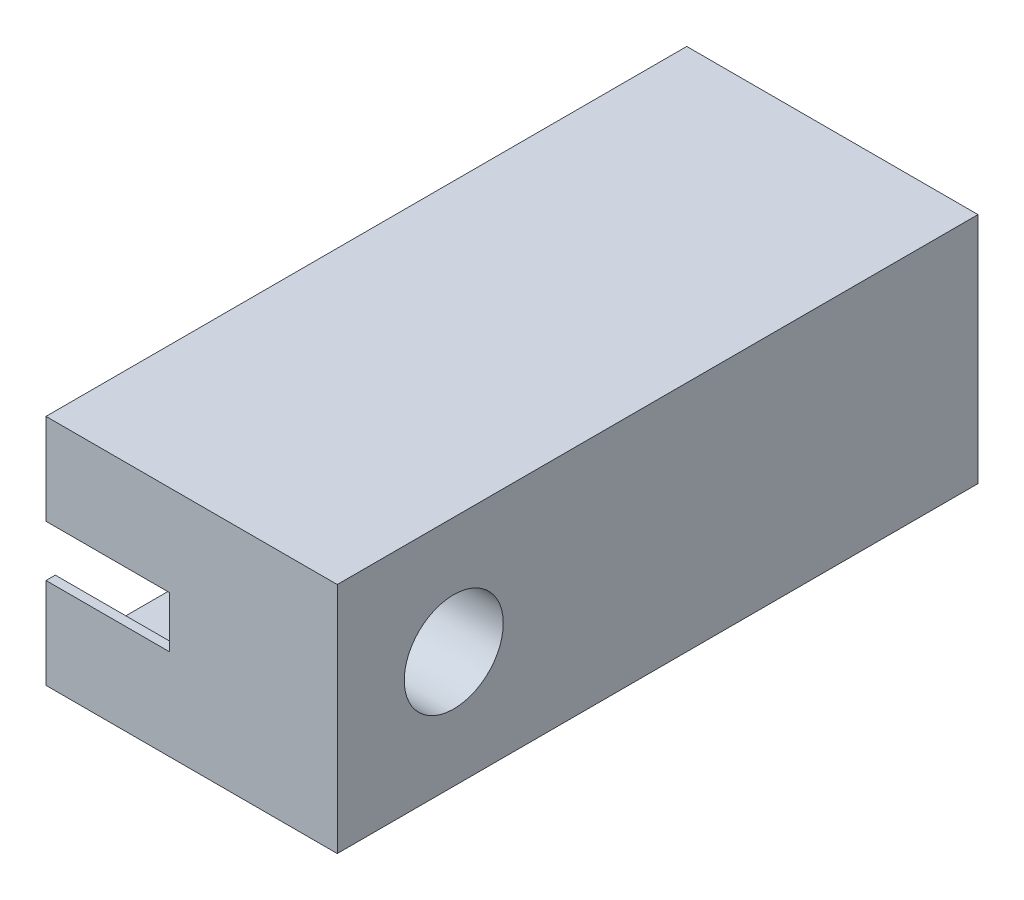
ISO-10303-21;
HEADER;
FILE_DESCRIPTION(('STEP AP214'),'2;1');
FILE_NAME('part.step','',(''),(''),'','','');
FILE_SCHEMA(('AUTOMOTIVE_DESIGN { 1 0 10303 214 1 1 1 1 }'));
ENDSEC;
DATA;
#1=APPLICATION_CONTEXT('core data for automotive mechanical design processes');
#2=APPLICATION_PROTOCOL_DEFINITION('international standard','automotive_design',2000,#1);
#3=PRODUCT_CONTEXT('',#1,'mechanical');
#4=PRODUCT('Part','Part','',(#3));
#5=PRODUCT_RELATED_PRODUCT_CATEGORY('part','',(#4));
#6=PRODUCT_DEFINITION_FORMATION('','',#4);
#7=PRODUCT_DEFINITION_CONTEXT('part definition',#1,'design');
#8=PRODUCT_DEFINITION('design','',#6,#7);
#9=PRODUCT_DEFINITION_SHAPE('','',#8);
#10=(LENGTH_UNIT() NAMED_UNIT(*) SI_UNIT(.MILLI.,.METRE.));
#11=(NAMED_UNIT(*) PLANE_ANGLE_UNIT() SI_UNIT($,.RADIAN.));
#12=(NAMED_UNIT(*) SI_UNIT($,.STERADIAN.) SOLID_ANGLE_UNIT());
#13=UNCERTAINTY_MEASURE_WITH_UNIT(LENGTH_MEASURE(1.E-05),#10,'distance_accuracy_value','');
#14=(GEOMETRIC_REPRESENTATION_CONTEXT(3) GLOBAL_UNCERTAINTY_ASSIGNED_CONTEXT((#13)) GLOBAL_UNIT_ASSIGNED_CONTEXT((#10,
#11,#12)) REPRESENTATION_CONTEXT('',''));
#15=CARTESIAN_POINT('',(0.,0.,0.));
#16=DIRECTION('',(0.,0.,1.));
#17=DIRECTION('',(1.,0.,0.));
#18=AXIS2_PLACEMENT_3D('',#15,#16,#17);
#19=CARTESIAN_POINT('',(31.75,6.35,-53.975));
#20=DIRECTION('',(-1.,0.,0.));
#21=DIRECTION('',(0.,0.,1.));
#22=AXIS2_PLACEMENT_3D('',#19,#20,#21);
#23=CYLINDRICAL_SURFACE('',#22,1.5875);
#24=CARTESIAN_POINT('',(22.86,6.35,-53.975));
#25=DIRECTION('',(-1.,0.,0.));
#26=DIRECTION('',(0.,0.,1.));
#27=AXIS2_PLACEMENT_3D('',#24,#25,#26);
#28=CIRCLE('',#27,1.5875);
#29=CARTESIAN_POINT('',(22.86,6.35,-52.3875));
#30=VERTEX_POINT('',#29);
#31=EDGE_CURVE('E359',#30,#30,#28,.T.);
#32=ORIENTED_EDGE('',*,*,#31,.T.);
#33=EDGE_LOOP('',(#32));
#34=FACE_BOUND('',#33,.T.);
#35=CARTESIAN_POINT('',(29.21,6.35,-53.975));
#36=DIRECTION('',(1.,0.,0.));
#37=DIRECTION('',(0.,0.,-1.));
#38=AXIS2_PLACEMENT_3D('',#35,#36,#37);
#39=CIRCLE('',#38,1.5875);
#40=CARTESIAN_POINT('',(29.21,6.35,-55.5625));
#41=VERTEX_POINT('',#40);
#42=EDGE_CURVE('E11',#41,#41,#39,.F.);
#43=ORIENTED_EDGE('',*,*,#42,.F.);
#44=EDGE_LOOP('',(#43));
#45=FACE_BOUND('',#44,.T.);
#46=ADVANCED_FACE('F45',(#34,#45),#23,.F.);
#47=CARTESIAN_POINT('',(31.75,-6.35,-53.975));
#48=DIRECTION('',(-1.,0.,0.));
#49=DIRECTION('',(0.,0.,1.));
#50=AXIS2_PLACEMENT_3D('',#47,#48,#49);
#51=CYLINDRICAL_SURFACE('',#50,1.5875);
#52=CARTESIAN_POINT('',(22.86,-6.35,-53.975));
#53=DIRECTION('',(-1.,0.,0.));
#54=DIRECTION('',(0.,0.,1.));
#55=AXIS2_PLACEMENT_3D('',#52,#53,#54);
#56=CIRCLE('',#55,1.5875);
#57=CARTESIAN_POINT('',(22.86,-6.35,-52.3875));
#58=VERTEX_POINT('',#57);
#59=EDGE_CURVE('E362',#58,#58,#56,.T.);
#60=ORIENTED_EDGE('',*,*,#59,.T.);
#61=EDGE_LOOP('',(#60));
#62=FACE_BOUND('',#61,.T.);
#63=CARTESIAN_POINT('',(29.21,-6.35,-53.975));
#64=DIRECTION('',(1.,0.,0.));
#65=DIRECTION('',(0.,0.,-1.));
#66=AXIS2_PLACEMENT_3D('',#63,#64,#65);
#67=CIRCLE('',#66,1.5875);
#68=CARTESIAN_POINT('',(29.21,-6.35,-55.5625));
#69=VERTEX_POINT('',#68);
#70=EDGE_CURVE('E54',#69,#69,#67,.F.);
#71=ORIENTED_EDGE('',*,*,#70,.F.);
#72=EDGE_LOOP('',(#71));
#73=FACE_BOUND('',#72,.T.);
#74=ADVANCED_FACE('F266',(#62,#73),#51,.F.);
#75=CARTESIAN_POINT('',(0.,0.,0.));
#76=DIRECTION('',(1.,0.,0.));
#77=DIRECTION('',(0.,0.,-1.));
#78=AXIS2_PLACEMENT_3D('',#75,#76,#77);
#79=PLANE('',#78);
#80=DIRECTION('',(0.,0.,1.));
#81=VECTOR('',#80,1.);
#82=CARTESIAN_POINT('',(0.,2.794,11.684));
#83=LINE('',#82,#81);
#84=CARTESIAN_POINT('',(0.,2.794,11.684));
#85=VERTEX_POINT('',#84);
#86=CARTESIAN_POINT('',(0.,2.794,12.7));
#87=VERTEX_POINT('',#86);
#88=EDGE_CURVE('E355',#85,#87,#83,.T.);
#89=ORIENTED_EDGE('',*,*,#88,.T.);
#90=DIRECTION('',(0.,-1.,0.));
#91=VECTOR('',#90,1.);
#92=CARTESIAN_POINT('',(0.,12.7,12.7));
#93=LINE('',#92,#91);
#94=CARTESIAN_POINT('',(0.,12.7,12.7));
#95=VERTEX_POINT('',#94);
#96=EDGE_CURVE('E223',#95,#87,#93,.T.);
#97=ORIENTED_EDGE('',*,*,#96,.F.);
#98=DIRECTION('',(0.,0.,1.));
#99=VECTOR('',#98,1.);
#100=CARTESIAN_POINT('',(0.,12.7,12.7));
#101=LINE('',#100,#99);
#102=CARTESIAN_POINT('',(0.,12.7,-57.15));
#103=VERTEX_POINT('',#102);
#104=EDGE_CURVE('E213',#103,#95,#101,.T.);
#105=ORIENTED_EDGE('',*,*,#104,.F.);
#106=DIRECTION('',(0.,1.,0.));
#107=VECTOR('',#106,1.);
#108=CARTESIAN_POINT('',(0.,12.7,-57.15));
#109=LINE('',#108,#107);
#110=CARTESIAN_POINT('',(0.,10.4775,-57.15));
#111=VERTEX_POINT('',#110);
#112=EDGE_CURVE('E230',#111,#103,#109,.T.);
#113=ORIENTED_EDGE('',*,*,#112,.F.);
#114=DIRECTION('',(0.,0.,1.));
#115=VECTOR('',#114,1.);
#116=CARTESIAN_POINT('',(0.,10.4775,-59.69));
#117=LINE('',#116,#115);
#118=CARTESIAN_POINT('',(0.,10.4775,11.684));
#119=VERTEX_POINT('',#118);
#120=EDGE_CURVE('E186',#111,#119,#117,.T.);
#121=ORIENTED_EDGE('',*,*,#120,.T.);
#122=DIRECTION('',(0.,-1.,0.));
#123=VECTOR('',#122,1.);
#124=CARTESIAN_POINT('',(0.,10.4775,11.684));
#125=LINE('',#124,#123);
#126=EDGE_CURVE('E176',#119,#85,#125,.T.);
#127=ORIENTED_EDGE('',*,*,#126,.T.);
#128=EDGE_LOOP('',(#89,#97,#105,#113,#121,#127));
#129=FACE_BOUND('',#128,.T.);
#130=ADVANCED_FACE('F268',(#129),#79,.F.);
#131=CARTESIAN_POINT('',(31.75,12.7,12.7));
#132=DIRECTION('',(0.,0.,-1.));
#133=DIRECTION('',(0.,1.,0.));
#134=AXIS2_PLACEMENT_3D('',#131,#132,#133);
#135=PLANE('',#134);
#136=DIRECTION('',(-1.,0.,0.));
#137=VECTOR('',#136,1.);
#138=CARTESIAN_POINT('',(31.75,2.794,12.7));
#139=LINE('',#138,#137);
#140=CARTESIAN_POINT('',(13.462,2.794,12.7));
#141=VERTEX_POINT('',#140);
#142=EDGE_CURVE('E168',#141,#87,#139,.T.);
#143=ORIENTED_EDGE('',*,*,#142,.F.);
#144=DIRECTION('',(0.,-1.,0.));
#145=VECTOR('',#144,1.);
#146=CARTESIAN_POINT('',(13.462,12.7,12.7));
#147=LINE('',#146,#145);
#148=CARTESIAN_POINT('',(13.462,-2.794,12.7));
#149=VERTEX_POINT('',#148);
#150=EDGE_CURVE('E158',#141,#149,#147,.T.);
#151=ORIENTED_EDGE('',*,*,#150,.T.);
#152=DIRECTION('',(-1.,0.,0.));
#153=VECTOR('',#152,1.);
#154=CARTESIAN_POINT('',(31.75,-2.794,12.7));
#155=LINE('',#154,#153);
#156=CARTESIAN_POINT('',(0.,-2.794,12.7));
#157=VERTEX_POINT('',#156);
#158=EDGE_CURVE('E141',#149,#157,#155,.T.);
#159=ORIENTED_EDGE('',*,*,#158,.T.);
#160=CARTESIAN_POINT('',(0.,-12.7,12.7));
#161=VERTEX_POINT('',#160);
#162=EDGE_CURVE('E207',#157,#161,#93,.T.);
#163=ORIENTED_EDGE('',*,*,#162,.T.);
#164=DIRECTION('',(-1.,0.,0.));
#165=VECTOR('',#164,1.);
#166=CARTESIAN_POINT('',(31.75,-12.7,12.7));
#167=LINE('',#166,#165);
#168=CARTESIAN_POINT('',(31.75,-12.7,12.7));
#169=VERTEX_POINT('',#168);
#170=EDGE_CURVE('E248',#169,#161,#167,.T.);
#171=ORIENTED_EDGE('',*,*,#170,.F.);
#172=DIRECTION('',(0.,-1.,0.));
#173=VECTOR('',#172,1.);
#174=CARTESIAN_POINT('',(31.75,12.7,12.7));
#175=LINE('',#174,#173);
#176=CARTESIAN_POINT('',(31.75,12.7,12.7));
#177=VERTEX_POINT('',#176);
#178=EDGE_CURVE('E208',#177,#169,#175,.T.);
#179=ORIENTED_EDGE('',*,*,#178,.F.);
#180=DIRECTION('',(-1.,0.,0.));
#181=VECTOR('',#180,1.);
#182=CARTESIAN_POINT('',(31.75,12.7,12.7));
#183=LINE('',#182,#181);
#184=EDGE_CURVE('E222',#177,#95,#183,.T.);
#185=ORIENTED_EDGE('',*,*,#184,.T.);
#186=ORIENTED_EDGE('',*,*,#96,.T.);
#187=EDGE_LOOP('',(#143,#151,#159,#163,#171,#179,#185,#186));
#188=FACE_BOUND('',#187,.T.);
#189=ADVANCED_FACE('F47',(#188),#135,.F.);
#190=CARTESIAN_POINT('',(22.86,10.4775,11.684));
#191=DIRECTION('',(0.,0.,-1.));
#192=DIRECTION('',(-1.,0.,0.));
#193=AXIS2_PLACEMENT_3D('',#190,#191,#192);
#194=PLANE('',#193);
#195=DIRECTION('',(0.,-1.,0.));
#196=VECTOR('',#195,1.);
#197=CARTESIAN_POINT('',(13.462,2.794,11.684));
#198=LINE('',#197,#196);
#199=CARTESIAN_POINT('',(13.462,2.794,11.684));
#200=VERTEX_POINT('',#199);
#201=CARTESIAN_POINT('',(13.462,-2.794,11.684));
#202=VERTEX_POINT('',#201);
#203=EDGE_CURVE('E144',#200,#202,#198,.T.);
#204=ORIENTED_EDGE('',*,*,#203,.F.);
#205=DIRECTION('',(-1.,0.,0.));
#206=VECTOR('',#205,1.);
#207=CARTESIAN_POINT('',(13.462,2.794,11.684));
#208=LINE('',#207,#206);
#209=EDGE_CURVE('E151',#200,#85,#208,.T.);
#210=ORIENTED_EDGE('',*,*,#209,.T.);
#211=ORIENTED_EDGE('',*,*,#126,.F.);
#212=DIRECTION('',(-1.,0.,0.));
#213=VECTOR('',#212,1.);
#214=CARTESIAN_POINT('',(22.86,10.4775,11.684));
#215=LINE('',#214,#213);
#216=CARTESIAN_POINT('',(22.86,10.4775,11.684));
#217=VERTEX_POINT('',#216);
#218=EDGE_CURVE('E195',#217,#119,#215,.T.);
#219=ORIENTED_EDGE('',*,*,#218,.F.);
#220=DIRECTION('',(0.,-1.,0.));
#221=VECTOR('',#220,1.);
#222=CARTESIAN_POINT('',(22.86,10.4775,11.684));
#223=LINE('',#222,#221);
#224=CARTESIAN_POINT('',(22.86,-10.4775,11.684));
#225=VERTEX_POINT('',#224);
#226=EDGE_CURVE('E179',#217,#225,#223,.T.);
#227=ORIENTED_EDGE('',*,*,#226,.T.);
#228=DIRECTION('',(-1.,0.,0.));
#229=VECTOR('',#228,1.);
#230=CARTESIAN_POINT('',(22.86,-10.4775,11.684));
#231=LINE('',#230,#229);
#232=CARTESIAN_POINT('',(0.,-10.4775,11.684));
#233=VERTEX_POINT('',#232);
#234=EDGE_CURVE('E182',#225,#233,#231,.T.);
#235=ORIENTED_EDGE('',*,*,#234,.T.);
#236=CARTESIAN_POINT('',(0.,-2.794,11.684));
#237=VERTEX_POINT('',#236);
#238=EDGE_CURVE('E156',#237,#233,#125,.T.);
#239=ORIENTED_EDGE('',*,*,#238,.F.);
#240=DIRECTION('',(-1.,0.,0.));
#241=VECTOR('',#240,1.);
#242=CARTESIAN_POINT('',(13.462,-2.794,11.684));
#243=LINE('',#242,#241);
#244=EDGE_CURVE('E138',#202,#237,#243,.T.);
#245=ORIENTED_EDGE('',*,*,#244,.F.);
#246=EDGE_LOOP('',(#204,#210,#211,#219,#227,#235,#239,#245));
#247=FACE_BOUND('',#246,.T.);
#248=ADVANCED_FACE('F154',(#247),#194,.T.);
#249=ORIENTED_EDGE('',*,*,#162,.F.);
#250=DIRECTION('',(0.,0.,1.));
#251=VECTOR('',#250,1.);
#252=CARTESIAN_POINT('',(0.,-2.794,11.684));
#253=LINE('',#252,#251);
#254=EDGE_CURVE('E353',#237,#157,#253,.T.);
#255=ORIENTED_EDGE('',*,*,#254,.F.);
#256=ORIENTED_EDGE('',*,*,#238,.T.);
#257=DIRECTION('',(0.,0.,-1.));
#258=VECTOR('',#257,1.);
#259=CARTESIAN_POINT('',(0.,-10.4775,11.684));
#260=LINE('',#259,#258);
#261=CARTESIAN_POINT('',(0.,-10.4775,-57.15));
#262=VERTEX_POINT('',#261);
#263=EDGE_CURVE('E171',#233,#262,#260,.T.);
#264=ORIENTED_EDGE('',*,*,#263,.T.);
#265=CARTESIAN_POINT('',(0.,-12.7,-57.15));
#266=VERTEX_POINT('',#265);
#267=EDGE_CURVE('E231',#266,#262,#109,.T.);
#268=ORIENTED_EDGE('',*,*,#267,.F.);
#269=DIRECTION('',(0.,0.,-1.));
#270=VECTOR('',#269,1.);
#271=CARTESIAN_POINT('',(0.,-12.7,12.7));
#272=LINE('',#271,#270);
#273=EDGE_CURVE('E227',#161,#266,#272,.T.);
#274=ORIENTED_EDGE('',*,*,#273,.F.);
#275=EDGE_LOOP('',(#249,#255,#256,#264,#268,#274));
#276=FACE_BOUND('',#275,.T.);
#277=ADVANCED_FACE('F278',(#276),#79,.F.);
#278=CARTESIAN_POINT('',(31.75,12.7,-57.15));
#279=DIRECTION('',(0.,0.,1.));
#280=DIRECTION('',(0.,-1.,0.));
#281=AXIS2_PLACEMENT_3D('',#278,#279,#280);
#282=PLANE('',#281);
#283=DIRECTION('',(-1.,0.,0.));
#284=VECTOR('',#283,1.);
#285=CARTESIAN_POINT('',(31.75,-10.4775,-57.15));
#286=LINE('',#285,#284);
#287=CARTESIAN_POINT('',(22.86,-10.4775,-57.15));
#288=VERTEX_POINT('',#287);
#289=EDGE_CURVE('E258',#288,#262,#286,.T.);
#290=ORIENTED_EDGE('',*,*,#289,.F.);
#291=DIRECTION('',(0.,1.,0.));
#292=VECTOR('',#291,1.);
#293=CARTESIAN_POINT('',(22.86,12.7,-57.15));
#294=LINE('',#293,#292);
#295=CARTESIAN_POINT('',(22.86,10.4775,-57.15));
#296=VERTEX_POINT('',#295);
#297=EDGE_CURVE('E199',#288,#296,#294,.T.);
#298=ORIENTED_EDGE('',*,*,#297,.T.);
#299=DIRECTION('',(1.,0.,0.));
#300=VECTOR('',#299,1.);
#301=CARTESIAN_POINT('',(31.75,10.4775,-57.15));
#302=LINE('',#301,#300);
#303=EDGE_CURVE('E252',#111,#296,#302,.T.);
#304=ORIENTED_EDGE('',*,*,#303,.F.);
#305=ORIENTED_EDGE('',*,*,#112,.T.);
#306=DIRECTION('',(-1.,0.,0.));
#307=VECTOR('',#306,1.);
#308=CARTESIAN_POINT('',(31.75,12.7,-57.15));
#309=LINE('',#308,#307);
#310=CARTESIAN_POINT('',(31.75,12.7,-57.15));
#311=VERTEX_POINT('',#310);
#312=EDGE_CURVE('E240',#311,#103,#309,.T.);
#313=ORIENTED_EDGE('',*,*,#312,.F.);
#314=DIRECTION('',(0.,1.,0.));
#315=VECTOR('',#314,1.);
#316=CARTESIAN_POINT('',(31.75,12.7,-57.15));
#317=LINE('',#316,#315);
#318=CARTESIAN_POINT('',(31.75,-12.7,-57.15));
#319=VERTEX_POINT('',#318);
#320=EDGE_CURVE('E216',#319,#311,#317,.T.);
#321=ORIENTED_EDGE('',*,*,#320,.F.);
#322=DIRECTION('',(-1.,0.,0.));
#323=VECTOR('',#322,1.);
#324=CARTESIAN_POINT('',(31.75,-12.7,-57.15));
#325=LINE('',#324,#323);
#326=EDGE_CURVE('E244',#319,#266,#325,.T.);
#327=ORIENTED_EDGE('',*,*,#326,.T.);
#328=ORIENTED_EDGE('',*,*,#267,.T.);
#329=EDGE_LOOP('',(#290,#298,#304,#305,#313,#321,#327,#328));
#330=FACE_BOUND('',#329,.T.);
#331=ADVANCED_FACE('F314',(#330),#282,.F.);
#332=CARTESIAN_POINT('',(31.75,0.,0.));
#333=DIRECTION('',(1.,0.,0.));
#334=DIRECTION('',(0.,0.,-1.));
#335=AXIS2_PLACEMENT_3D('',#332,#333,#334);
#336=PLANE('',#335);
#337=ORIENTED_EDGE('',*,*,#178,.T.);
#338=DIRECTION('',(0.,0.,-1.));
#339=VECTOR('',#338,1.);
#340=CARTESIAN_POINT('',(31.75,-12.7,12.7));
#341=LINE('',#340,#339);
#342=EDGE_CURVE('E212',#169,#319,#341,.T.);
#343=ORIENTED_EDGE('',*,*,#342,.T.);
#344=ORIENTED_EDGE('',*,*,#320,.T.);
#345=DIRECTION('',(0.,0.,1.));
#346=VECTOR('',#345,1.);
#347=CARTESIAN_POINT('',(31.75,12.7,12.7));
#348=LINE('',#347,#346);
#349=EDGE_CURVE('E219',#311,#177,#348,.T.);
#350=ORIENTED_EDGE('',*,*,#349,.T.);
#351=EDGE_LOOP('',(#337,#343,#344,#350));
#352=FACE_BOUND('',#351,.T.);
#353=CARTESIAN_POINT('',(31.75,0.,0.));
#354=DIRECTION('',(1.,0.,0.));
#355=DIRECTION('',(0.,0.,-1.));
#356=AXIS2_PLACEMENT_3D('',#353,#354,#355);
#357=CIRCLE('',#356,5.3975);
#358=CARTESIAN_POINT('',(31.75,0.,-5.3975));
#359=VERTEX_POINT('',#358);
#360=EDGE_CURVE('E203',#359,#359,#357,.T.);
#361=ORIENTED_EDGE('',*,*,#360,.F.);
#362=EDGE_LOOP('',(#361));
#363=FACE_BOUND('',#362,.T.);
#364=ADVANCED_FACE('F311',(#352,#363),#336,.T.);
#365=CARTESIAN_POINT('',(31.75,-12.7,12.7));
#366=DIRECTION('',(0.,1.,0.));
#367=DIRECTION('',(0.,0.,1.));
#368=AXIS2_PLACEMENT_3D('',#365,#366,#367);
#369=PLANE('',#368);
#370=ORIENTED_EDGE('',*,*,#273,.T.);
#371=ORIENTED_EDGE('',*,*,#326,.F.);
#372=ORIENTED_EDGE('',*,*,#342,.F.);
#373=ORIENTED_EDGE('',*,*,#170,.T.);
#374=EDGE_LOOP('',(#370,#371,#372,#373));
#375=FACE_BOUND('',#374,.T.);
#376=ADVANCED_FACE('F313',(#375),#369,.F.);
#377=CARTESIAN_POINT('',(31.75,12.7,12.7));
#378=DIRECTION('',(0.,-1.,0.));
#379=DIRECTION('',(0.,0.,-1.));
#380=AXIS2_PLACEMENT_3D('',#377,#378,#379);
#381=PLANE('',#380);
#382=ORIENTED_EDGE('',*,*,#104,.T.);
#383=ORIENTED_EDGE('',*,*,#184,.F.);
#384=ORIENTED_EDGE('',*,*,#349,.F.);
#385=ORIENTED_EDGE('',*,*,#312,.T.);
#386=EDGE_LOOP('',(#382,#383,#384,#385));
#387=FACE_BOUND('',#386,.T.);
#388=ADVANCED_FACE('F309',(#387),#381,.F.);
#389=CARTESIAN_POINT('',(31.75,0.,0.));
#390=DIRECTION('',(-1.,0.,0.));
#391=DIRECTION('',(0.,0.,1.));
#392=AXIS2_PLACEMENT_3D('',#389,#390,#391);
#393=CYLINDRICAL_SURFACE('',#392,5.3975);
#394=CARTESIAN_POINT('',(22.86,0.,0.));
#395=DIRECTION('',(1.,0.,0.));
#396=DIRECTION('',(0.,0.,-1.));
#397=AXIS2_PLACEMENT_3D('',#394,#395,#396);
#398=CIRCLE('',#397,5.3975);
#399=CARTESIAN_POINT('',(22.86,0.,-5.3975));
#400=VERTEX_POINT('',#399);
#401=EDGE_CURVE('E198',#400,#400,#398,.T.);
#402=ORIENTED_EDGE('',*,*,#401,.F.);
#403=EDGE_LOOP('',(#402));
#404=FACE_BOUND('',#403,.T.);
#405=ORIENTED_EDGE('',*,*,#360,.T.);
#406=EDGE_LOOP('',(#405));
#407=FACE_BOUND('',#406,.T.);
#408=ADVANCED_FACE('F305',(#404,#407),#393,.F.);
#409=CARTESIAN_POINT('',(22.86,-10.4775,11.684));
#410=DIRECTION('',(0.,1.,0.));
#411=DIRECTION('',(0.,0.,1.));
#412=AXIS2_PLACEMENT_3D('',#409,#410,#411);
#413=PLANE('',#412);
#414=ORIENTED_EDGE('',*,*,#289,.T.);
#415=ORIENTED_EDGE('',*,*,#263,.F.);
#416=ORIENTED_EDGE('',*,*,#234,.F.);
#417=DIRECTION('',(0.,0.,-1.));
#418=VECTOR('',#417,1.);
#419=CARTESIAN_POINT('',(22.86,-10.4775,11.684));
#420=LINE('',#419,#418);
#421=EDGE_CURVE('E172',#225,#288,#420,.T.);
#422=ORIENTED_EDGE('',*,*,#421,.T.);
#423=EDGE_LOOP('',(#414,#415,#416,#422));
#424=FACE_BOUND('',#423,.T.);
#425=ADVANCED_FACE('F301',(#424),#413,.T.);
#426=CARTESIAN_POINT('',(22.86,10.4775,-59.69));
#427=DIRECTION('',(0.,-1.,0.));
#428=DIRECTION('',(0.,0.,-1.));
#429=AXIS2_PLACEMENT_3D('',#426,#427,#428);
#430=PLANE('',#429);
#431=ORIENTED_EDGE('',*,*,#303,.T.);
#432=DIRECTION('',(0.,0.,1.));
#433=VECTOR('',#432,1.);
#434=CARTESIAN_POINT('',(22.86,10.4775,-59.69));
#435=LINE('',#434,#433);
#436=EDGE_CURVE('E69',#296,#217,#435,.T.);
#437=ORIENTED_EDGE('',*,*,#436,.T.);
#438=ORIENTED_EDGE('',*,*,#218,.T.);
#439=ORIENTED_EDGE('',*,*,#120,.F.);
#440=EDGE_LOOP('',(#431,#437,#438,#439));
#441=FACE_BOUND('',#440,.T.);
#442=ADVANCED_FACE('F295',(#441),#430,.T.);
#443=CARTESIAN_POINT('',(22.86,0.,0.));
#444=DIRECTION('',(1.,0.,0.));
#445=DIRECTION('',(0.,0.,-1.));
#446=AXIS2_PLACEMENT_3D('',#443,#444,#445);
#447=PLANE('',#446);
#448=ORIENTED_EDGE('',*,*,#31,.F.);
#449=EDGE_LOOP('',(#448));
#450=FACE_BOUND('',#449,.T.);
#451=ORIENTED_EDGE('',*,*,#59,.F.);
#452=EDGE_LOOP('',(#451));
#453=FACE_BOUND('',#452,.T.);
#454=ORIENTED_EDGE('',*,*,#401,.T.);
#455=EDGE_LOOP('',(#454));
#456=FACE_BOUND('',#455,.T.);
#457=ORIENTED_EDGE('',*,*,#421,.F.);
#458=ORIENTED_EDGE('',*,*,#226,.F.);
#459=ORIENTED_EDGE('',*,*,#436,.F.);
#460=ORIENTED_EDGE('',*,*,#297,.F.);
#461=EDGE_LOOP('',(#457,#458,#459,#460));
#462=FACE_BOUND('',#461,.T.);
#463=ADVANCED_FACE('F291',(#450,#453,#456,#462),#447,.F.);
#464=CARTESIAN_POINT('',(13.462,2.794,11.684));
#465=DIRECTION('',(0.,-1.,0.));
#466=DIRECTION('',(0.,0.,-1.));
#467=AXIS2_PLACEMENT_3D('',#464,#465,#466);
#468=PLANE('',#467);
#469=ORIENTED_EDGE('',*,*,#142,.T.);
#470=ORIENTED_EDGE('',*,*,#88,.F.);
#471=ORIENTED_EDGE('',*,*,#209,.F.);
#472=DIRECTION('',(0.,0.,1.));
#473=VECTOR('',#472,1.);
#474=CARTESIAN_POINT('',(13.462,2.794,11.684));
#475=LINE('',#474,#473);
#476=EDGE_CURVE('E61',#200,#141,#475,.T.);
#477=ORIENTED_EDGE('',*,*,#476,.T.);
#478=EDGE_LOOP('',(#469,#470,#471,#477));
#479=FACE_BOUND('',#478,.T.);
#480=ADVANCED_FACE('F288',(#479),#468,.T.);
#481=CARTESIAN_POINT('',(13.462,-2.794,11.684));
#482=DIRECTION('',(0.,-1.,0.));
#483=DIRECTION('',(0.,0.,-1.));
#484=AXIS2_PLACEMENT_3D('',#481,#482,#483);
#485=PLANE('',#484);
#486=DIRECTION('',(0.,0.,1.));
#487=VECTOR('',#486,1.);
#488=CARTESIAN_POINT('',(13.462,-2.794,11.684));
#489=LINE('',#488,#487);
#490=EDGE_CURVE('E135',#202,#149,#489,.T.);
#491=ORIENTED_EDGE('',*,*,#490,.F.);
#492=ORIENTED_EDGE('',*,*,#244,.T.);
#493=ORIENTED_EDGE('',*,*,#254,.T.);
#494=ORIENTED_EDGE('',*,*,#158,.F.);
#495=EDGE_LOOP('',(#491,#492,#493,#494));
#496=FACE_BOUND('',#495,.T.);
#497=ADVANCED_FACE('F136',(#496),#485,.F.);
#498=CARTESIAN_POINT('',(13.462,0.,0.));
#499=DIRECTION('',(1.,0.,0.));
#500=DIRECTION('',(0.,0.,-1.));
#501=AXIS2_PLACEMENT_3D('',#498,#499,#500);
#502=PLANE('',#501);
#503=ORIENTED_EDGE('',*,*,#476,.F.);
#504=ORIENTED_EDGE('',*,*,#203,.T.);
#505=ORIENTED_EDGE('',*,*,#490,.T.);
#506=ORIENTED_EDGE('',*,*,#150,.F.);
#507=EDGE_LOOP('',(#503,#504,#505,#506));
#508=FACE_BOUND('',#507,.T.);
#509=ADVANCED_FACE('F147',(#508),#502,.F.);
#510=CARTESIAN_POINT('',(29.21,-6.35,-53.975));
#511=DIRECTION('',(1.,0.,0.));
#512=DIRECTION('',(0.,0.,-1.));
#513=AXIS2_PLACEMENT_3D('',#510,#511,#512);
#514=PLANE('',#513);
#515=ORIENTED_EDGE('',*,*,#70,.T.);
#516=EDGE_LOOP('',(#515));
#517=FACE_BOUND('',#516,.T.);
#518=ADVANCED_FACE('F264',(#517),#514,.F.);
#519=CARTESIAN_POINT('',(29.21,6.35,-53.975));
#520=DIRECTION('',(1.,0.,0.));
#521=DIRECTION('',(0.,0.,-1.));
#522=AXIS2_PLACEMENT_3D('',#519,#520,#521);
#523=PLANE('',#522);
#524=ORIENTED_EDGE('',*,*,#42,.T.);
#525=EDGE_LOOP('',(#524));
#526=FACE_BOUND('',#525,.T.);
#527=ADVANCED_FACE('F378',(#526),#523,.F.);
#528=CLOSED_SHELL('',(#46,#74,#130,#189,#248,#277,#331,#364,#376,#388,#408,#425,#442,#463,#480,
#497,#509,#518,#527));
#529=MANIFOLD_SOLID_BREP('B2',#528);
#530=ADVANCED_BREP_SHAPE_REPRESENTATION('',(#18,#529),#14);
#531=SHAPE_DEFINITION_REPRESENTATION(#9,#530);
ENDSEC;
END-ISO-10303-21;
